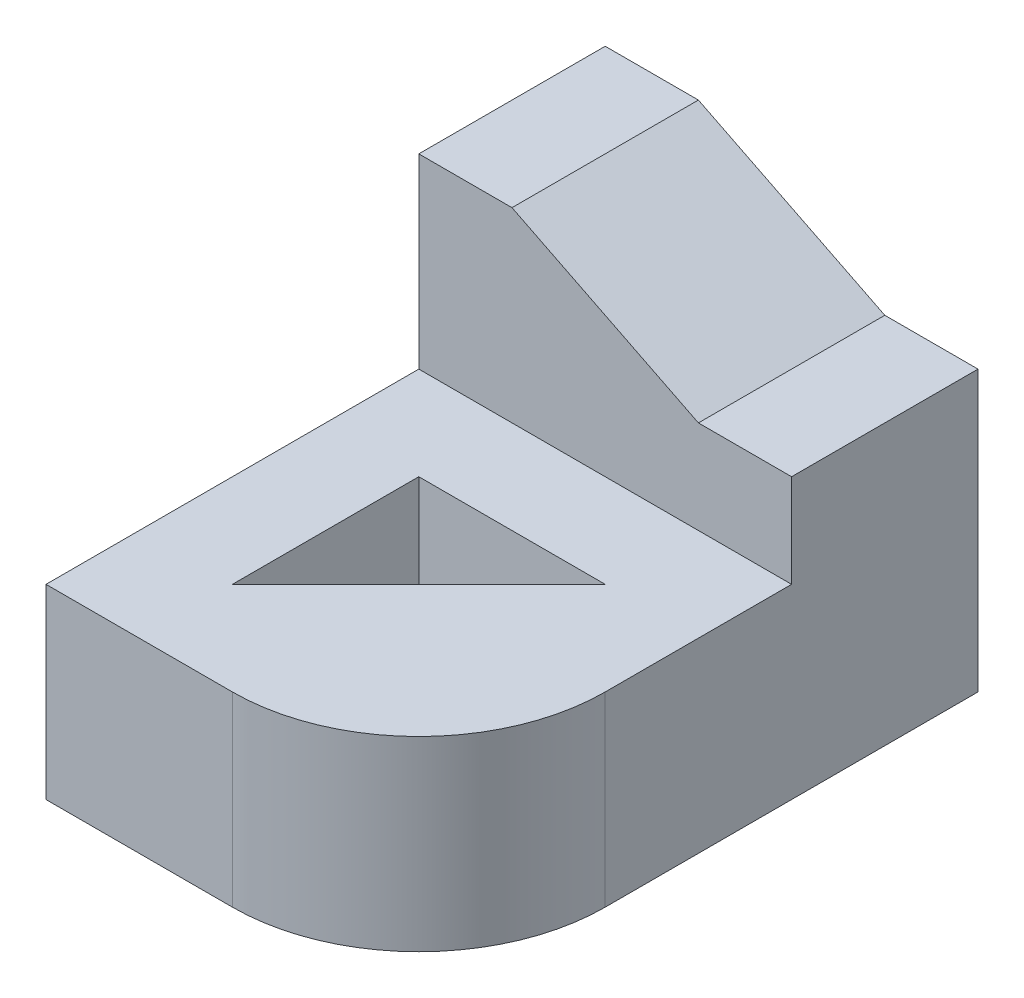
ISO-10303-21;
HEADER;
FILE_DESCRIPTION(('STEP AP214'),'2;1');
FILE_NAME('part.step','',(''),(''),'','','');
FILE_SCHEMA(('AUTOMOTIVE_DESIGN { 1 0 10303 214 1 1 1 1 }'));
ENDSEC;
DATA;
#1=APPLICATION_CONTEXT('core data for automotive mechanical design processes');
#2=APPLICATION_PROTOCOL_DEFINITION('international standard','automotive_design',2000,#1);
#3=PRODUCT_CONTEXT('',#1,'mechanical');
#4=PRODUCT('Part','Part','',(#3));
#5=PRODUCT_RELATED_PRODUCT_CATEGORY('part','',(#4));
#6=PRODUCT_DEFINITION_FORMATION('','',#4);
#7=PRODUCT_DEFINITION_CONTEXT('part definition',#1,'design');
#8=PRODUCT_DEFINITION('design','',#6,#7);
#9=PRODUCT_DEFINITION_SHAPE('','',#8);
#10=(LENGTH_UNIT() NAMED_UNIT(*) SI_UNIT(.MILLI.,.METRE.));
#11=(NAMED_UNIT(*) PLANE_ANGLE_UNIT() SI_UNIT($,.RADIAN.));
#12=(NAMED_UNIT(*) SI_UNIT($,.STERADIAN.) SOLID_ANGLE_UNIT());
#13=UNCERTAINTY_MEASURE_WITH_UNIT(LENGTH_MEASURE(1.E-05),#10,'distance_accuracy_value','');
#14=(GEOMETRIC_REPRESENTATION_CONTEXT(3) GLOBAL_UNCERTAINTY_ASSIGNED_CONTEXT((#13)) GLOBAL_UNIT_ASSIGNED_CONTEXT((#10,
#11,#12)) REPRESENTATION_CONTEXT('',''));
#15=CARTESIAN_POINT('',(0.,0.,0.));
#16=DIRECTION('',(0.,0.,1.));
#17=DIRECTION('',(1.,0.,0.));
#18=AXIS2_PLACEMENT_3D('',#15,#16,#17);
#19=CARTESIAN_POINT('',(10.,10.,0.));
#20=DIRECTION('',(1.,0.,0.));
#21=DIRECTION('',(0.,0.,-1.));
#22=AXIS2_PLACEMENT_3D('',#19,#20,#21);
#23=PLANE('',#22);
#24=DIRECTION('',(0.,0.,1.));
#25=VECTOR('',#24,1.);
#26=CARTESIAN_POINT('',(10.,10.,0.));
#27=LINE('',#26,#25);
#28=CARTESIAN_POINT('',(9.99999999999999,10.,-10.));
#29=VERTEX_POINT('',#28);
#30=CARTESIAN_POINT('',(10.,10.,0.));
#31=VERTEX_POINT('',#30);
#32=EDGE_CURVE('E184',#29,#31,#27,.T.);
#33=ORIENTED_EDGE('',*,*,#32,.T.);
#34=DIRECTION('',(0.,-1.,0.));
#35=VECTOR('',#34,1.);
#36=CARTESIAN_POINT('',(10.,0.,0.));
#37=LINE('',#36,#35);
#38=CARTESIAN_POINT('',(10.,0.,0.));
#39=VERTEX_POINT('',#38);
#40=EDGE_CURVE('E219',#31,#39,#37,.T.);
#41=ORIENTED_EDGE('',*,*,#40,.T.);
#42=DIRECTION('',(0.,0.,1.));
#43=VECTOR('',#42,1.);
#44=CARTESIAN_POINT('',(10.,0.,0.));
#45=LINE('',#44,#43);
#46=CARTESIAN_POINT('',(10.,0.,-20.));
#47=VERTEX_POINT('',#46);
#48=EDGE_CURVE('E202',#47,#39,#45,.T.);
#49=ORIENTED_EDGE('',*,*,#48,.F.);
#50=DIRECTION('',(0.,-1.,0.));
#51=VECTOR('',#50,1.);
#52=CARTESIAN_POINT('',(10.,20.,-20.));
#53=LINE('',#52,#51);
#54=CARTESIAN_POINT('',(9.99999999999999,15.,-20.));
#55=VERTEX_POINT('',#54);
#56=EDGE_CURVE('E172',#55,#47,#53,.T.);
#57=ORIENTED_EDGE('',*,*,#56,.F.);
#58=DIRECTION('',(0.,0.,1.));
#59=VECTOR('',#58,1.);
#60=CARTESIAN_POINT('',(9.99999999999999,15.,-30.));
#61=LINE('',#60,#59);
#62=CARTESIAN_POINT('',(9.99999999999999,15.,-10.));
#63=VERTEX_POINT('',#62);
#64=EDGE_CURVE('E135',#55,#63,#61,.T.);
#65=ORIENTED_EDGE('',*,*,#64,.T.);
#66=DIRECTION('',(0.,-1.,0.));
#67=VECTOR('',#66,1.);
#68=CARTESIAN_POINT('',(9.99999999999999,20.,-10.));
#69=LINE('',#68,#67);
#70=EDGE_CURVE('E149',#63,#29,#69,.T.);
#71=ORIENTED_EDGE('',*,*,#70,.T.);
#72=EDGE_LOOP('',(#33,#41,#49,#57,#65,#71));
#73=FACE_BOUND('',#72,.T.);
#74=ADVANCED_FACE('F39',(#73),#23,.T.);
#75=CARTESIAN_POINT('',(-10.,10.,0.));
#76=DIRECTION('',(1.,0.,0.));
#77=DIRECTION('',(0.,0.,-1.));
#78=AXIS2_PLACEMENT_3D('',#75,#76,#77);
#79=PLANE('',#78);
#80=DIRECTION('',(0.,0.,1.));
#81=VECTOR('',#80,1.);
#82=CARTESIAN_POINT('',(-10.,0.,0.));
#83=LINE('',#82,#81);
#84=CARTESIAN_POINT('',(-10.,0.,-20.));
#85=VERTEX_POINT('',#84);
#86=CARTESIAN_POINT('',(-10.,0.,10.));
#87=VERTEX_POINT('',#86);
#88=EDGE_CURVE('E204',#85,#87,#83,.T.);
#89=ORIENTED_EDGE('',*,*,#88,.T.);
#90=DIRECTION('',(0.,-1.,0.));
#91=VECTOR('',#90,1.);
#92=CARTESIAN_POINT('',(-10.,10.,10.));
#93=LINE('',#92,#91);
#94=CARTESIAN_POINT('',(-10.,10.,10.));
#95=VERTEX_POINT('',#94);
#96=EDGE_CURVE('E208',#95,#87,#93,.T.);
#97=ORIENTED_EDGE('',*,*,#96,.F.);
#98=DIRECTION('',(0.,0.,1.));
#99=VECTOR('',#98,1.);
#100=CARTESIAN_POINT('',(-10.,10.,0.));
#101=LINE('',#100,#99);
#102=CARTESIAN_POINT('',(-10.,10.,-9.99999999999999));
#103=VERTEX_POINT('',#102);
#104=EDGE_CURVE('E189',#103,#95,#101,.T.);
#105=ORIENTED_EDGE('',*,*,#104,.F.);
#106=DIRECTION('',(0.,-1.,0.));
#107=VECTOR('',#106,1.);
#108=CARTESIAN_POINT('',(-10.,20.,-9.99999999999999));
#109=LINE('',#108,#107);
#110=CARTESIAN_POINT('',(-10.,20.,-9.99999999999999));
#111=VERTEX_POINT('',#110);
#112=EDGE_CURVE('E164',#111,#103,#109,.T.);
#113=ORIENTED_EDGE('',*,*,#112,.F.);
#114=DIRECTION('',(0.,0.,-1.));
#115=VECTOR('',#114,1.);
#116=CARTESIAN_POINT('',(-10.,20.,0.));
#117=LINE('',#116,#115);
#118=CARTESIAN_POINT('',(-10.,20.,-20.));
#119=VERTEX_POINT('',#118);
#120=EDGE_CURVE('E161',#111,#119,#117,.T.);
#121=ORIENTED_EDGE('',*,*,#120,.T.);
#122=DIRECTION('',(0.,-1.,0.));
#123=VECTOR('',#122,1.);
#124=CARTESIAN_POINT('',(-10.,20.,-20.));
#125=LINE('',#124,#123);
#126=EDGE_CURVE('E169',#119,#85,#125,.T.);
#127=ORIENTED_EDGE('',*,*,#126,.T.);
#128=EDGE_LOOP('',(#89,#97,#105,#113,#121,#127));
#129=FACE_BOUND('',#128,.T.);
#130=ADVANCED_FACE('F239',(#129),#79,.F.);
#131=CARTESIAN_POINT('',(-5.,10.,0.));
#132=DIRECTION('',(1.,0.,0.));
#133=DIRECTION('',(0.,0.,-1.));
#134=AXIS2_PLACEMENT_3D('',#131,#132,#133);
#135=PLANE('',#134);
#136=DIRECTION('',(0.,0.,1.));
#137=VECTOR('',#136,1.);
#138=CARTESIAN_POINT('',(-5.,0.,0.));
#139=LINE('',#138,#137);
#140=CARTESIAN_POINT('',(-5.,0.,-5.));
#141=VERTEX_POINT('',#140);
#142=CARTESIAN_POINT('',(-5.,0.,5.));
#143=VERTEX_POINT('',#142);
#144=EDGE_CURVE('E175',#141,#143,#139,.T.);
#145=ORIENTED_EDGE('',*,*,#144,.F.);
#146=DIRECTION('',(0.,-1.,0.));
#147=VECTOR('',#146,1.);
#148=CARTESIAN_POINT('',(-5.,10.,-5.));
#149=LINE('',#148,#147);
#150=CARTESIAN_POINT('',(-5.,10.,-5.));
#151=VERTEX_POINT('',#150);
#152=EDGE_CURVE('E211',#151,#141,#149,.T.);
#153=ORIENTED_EDGE('',*,*,#152,.F.);
#154=DIRECTION('',(0.,0.,1.));
#155=VECTOR('',#154,1.);
#156=CARTESIAN_POINT('',(-5.,10.,0.));
#157=LINE('',#156,#155);
#158=CARTESIAN_POINT('',(-5.,10.,5.));
#159=VERTEX_POINT('',#158);
#160=EDGE_CURVE('E176',#151,#159,#157,.T.);
#161=ORIENTED_EDGE('',*,*,#160,.T.);
#162=DIRECTION('',(0.,-1.,0.));
#163=VECTOR('',#162,1.);
#164=CARTESIAN_POINT('',(-5.,10.,5.));
#165=LINE('',#164,#163);
#166=EDGE_CURVE('E194',#159,#143,#165,.T.);
#167=ORIENTED_EDGE('',*,*,#166,.T.);
#168=EDGE_LOOP('',(#145,#153,#161,#167));
#169=FACE_BOUND('',#168,.T.);
#170=ADVANCED_FACE('F251',(#169),#135,.T.);
#171=CARTESIAN_POINT('',(0.,10.,-5.));
#172=DIRECTION('',(0.,0.,-1.));
#173=DIRECTION('',(-1.,0.,0.));
#174=AXIS2_PLACEMENT_3D('',#171,#172,#173);
#175=PLANE('',#174);
#176=DIRECTION('',(1.,0.,0.));
#177=VECTOR('',#176,1.);
#178=CARTESIAN_POINT('',(0.,0.,-5.));
#179=LINE('',#178,#177);
#180=CARTESIAN_POINT('',(5.,0.,-5.));
#181=VERTEX_POINT('',#180);
#182=EDGE_CURVE('E197',#141,#181,#179,.T.);
#183=ORIENTED_EDGE('',*,*,#182,.T.);
#184=DIRECTION('',(0.,-1.,0.));
#185=VECTOR('',#184,1.);
#186=CARTESIAN_POINT('',(5.,10.,-5.));
#187=LINE('',#186,#185);
#188=CARTESIAN_POINT('',(5.,10.,-5.));
#189=VERTEX_POINT('',#188);
#190=EDGE_CURVE('E213',#189,#181,#187,.T.);
#191=ORIENTED_EDGE('',*,*,#190,.F.);
#192=DIRECTION('',(1.,0.,0.));
#193=VECTOR('',#192,1.);
#194=CARTESIAN_POINT('',(0.,10.,-5.));
#195=LINE('',#194,#193);
#196=EDGE_CURVE('E179',#151,#189,#195,.T.);
#197=ORIENTED_EDGE('',*,*,#196,.F.);
#198=ORIENTED_EDGE('',*,*,#152,.T.);
#199=EDGE_LOOP('',(#183,#191,#197,#198));
#200=FACE_BOUND('',#199,.T.);
#201=ADVANCED_FACE('F259',(#200),#175,.F.);
#202=CARTESIAN_POINT('',(0.,10.,0.));
#203=DIRECTION('',(0.707106781186548,0.,0.707106781186548));
#204=DIRECTION('',(0.707106781186548,0.,-0.707106781186548));
#205=AXIS2_PLACEMENT_3D('',#202,#203,#204);
#206=PLANE('',#205);
#207=DIRECTION('',(-0.707106781186548,0.,0.707106781186548));
#208=VECTOR('',#207,1.);
#209=CARTESIAN_POINT('',(0.,0.,0.));
#210=LINE('',#209,#208);
#211=EDGE_CURVE('E199',#181,#143,#210,.T.);
#212=ORIENTED_EDGE('',*,*,#211,.T.);
#213=ORIENTED_EDGE('',*,*,#166,.F.);
#214=DIRECTION('',(-0.707106781186548,0.,0.707106781186548));
#215=VECTOR('',#214,1.);
#216=CARTESIAN_POINT('',(0.,10.,0.));
#217=LINE('',#216,#215);
#218=EDGE_CURVE('E182',#189,#159,#217,.T.);
#219=ORIENTED_EDGE('',*,*,#218,.F.);
#220=ORIENTED_EDGE('',*,*,#190,.T.);
#221=EDGE_LOOP('',(#212,#213,#219,#220));
#222=FACE_BOUND('',#221,.T.);
#223=ADVANCED_FACE('F255',(#222),#206,.F.);
#224=CARTESIAN_POINT('',(0.,10.,10.));
#225=DIRECTION('',(0.,0.,-1.));
#226=DIRECTION('',(-1.,0.,0.));
#227=AXIS2_PLACEMENT_3D('',#224,#225,#226);
#228=PLANE('',#227);
#229=DIRECTION('',(1.,0.,0.));
#230=VECTOR('',#229,1.);
#231=CARTESIAN_POINT('',(0.,0.,10.));
#232=LINE('',#231,#230);
#233=CARTESIAN_POINT('',(0.,0.,10.));
#234=VERTEX_POINT('',#233);
#235=EDGE_CURVE('E180',#87,#234,#232,.T.);
#236=ORIENTED_EDGE('',*,*,#235,.T.);
#237=DIRECTION('',(0.,-1.,0.));
#238=VECTOR('',#237,1.);
#239=CARTESIAN_POINT('',(0.,10.,10.));
#240=LINE('',#239,#238);
#241=CARTESIAN_POINT('',(0.,10.,10.));
#242=VERTEX_POINT('',#241);
#243=EDGE_CURVE('E47',#234,#242,#240,.F.);
#244=ORIENTED_EDGE('',*,*,#243,.T.);
#245=DIRECTION('',(1.,0.,0.));
#246=VECTOR('',#245,1.);
#247=CARTESIAN_POINT('',(0.,10.,10.));
#248=LINE('',#247,#246);
#249=EDGE_CURVE('E192',#95,#242,#248,.T.);
#250=ORIENTED_EDGE('',*,*,#249,.F.);
#251=ORIENTED_EDGE('',*,*,#96,.T.);
#252=EDGE_LOOP('',(#236,#244,#250,#251));
#253=FACE_BOUND('',#252,.T.);
#254=ADVANCED_FACE('F258',(#253),#228,.F.);
#255=CARTESIAN_POINT('',(0.,10.,0.));
#256=DIRECTION('',(0.,1.,0.));
#257=DIRECTION('',(0.,0.,1.));
#258=AXIS2_PLACEMENT_3D('',#255,#256,#257);
#259=PLANE('',#258);
#260=ORIENTED_EDGE('',*,*,#160,.F.);
#261=ORIENTED_EDGE('',*,*,#196,.T.);
#262=ORIENTED_EDGE('',*,*,#218,.T.);
#263=EDGE_LOOP('',(#260,#261,#262));
#264=FACE_BOUND('',#263,.T.);
#265=ORIENTED_EDGE('',*,*,#249,.T.);
#266=CARTESIAN_POINT('',(0.,10.,0.));
#267=DIRECTION('',(0.,1.,0.));
#268=DIRECTION('',(0.,0.,1.));
#269=AXIS2_PLACEMENT_3D('',#266,#267,#268);
#270=CIRCLE('',#269,10.);
#271=EDGE_CURVE('E11',#242,#31,#270,.T.);
#272=ORIENTED_EDGE('',*,*,#271,.T.);
#273=ORIENTED_EDGE('',*,*,#32,.F.);
#274=DIRECTION('',(1.,0.,0.));
#275=VECTOR('',#274,1.);
#276=CARTESIAN_POINT('',(0.,10.,-10.));
#277=LINE('',#276,#275);
#278=EDGE_CURVE('E187',#103,#29,#277,.T.);
#279=ORIENTED_EDGE('',*,*,#278,.F.);
#280=ORIENTED_EDGE('',*,*,#104,.T.);
#281=EDGE_LOOP('',(#265,#272,#273,#279,#280));
#282=FACE_BOUND('',#281,.T.);
#283=ADVANCED_FACE('F236',(#264,#282),#259,.T.);
#284=CARTESIAN_POINT('',(0.,0.,0.));
#285=DIRECTION('',(0.,1.,0.));
#286=DIRECTION('',(0.,0.,1.));
#287=AXIS2_PLACEMENT_3D('',#284,#285,#286);
#288=PLANE('',#287);
#289=ORIENTED_EDGE('',*,*,#144,.T.);
#290=ORIENTED_EDGE('',*,*,#211,.F.);
#291=ORIENTED_EDGE('',*,*,#182,.F.);
#292=EDGE_LOOP('',(#289,#290,#291));
#293=FACE_BOUND('',#292,.T.);
#294=ORIENTED_EDGE('',*,*,#48,.T.);
#295=CARTESIAN_POINT('',(0.,0.,0.));
#296=DIRECTION('',(0.,1.,0.));
#297=DIRECTION('',(0.,0.,1.));
#298=AXIS2_PLACEMENT_3D('',#295,#296,#297);
#299=CIRCLE('',#298,10.);
#300=EDGE_CURVE('E61',#39,#234,#299,.F.);
#301=ORIENTED_EDGE('',*,*,#300,.T.);
#302=ORIENTED_EDGE('',*,*,#235,.F.);
#303=ORIENTED_EDGE('',*,*,#88,.F.);
#304=DIRECTION('',(1.,0.,0.));
#305=VECTOR('',#304,1.);
#306=CARTESIAN_POINT('',(0.,0.,-20.));
#307=LINE('',#306,#305);
#308=EDGE_CURVE('E155',#85,#47,#307,.T.);
#309=ORIENTED_EDGE('',*,*,#308,.T.);
#310=EDGE_LOOP('',(#294,#301,#302,#303,#309));
#311=FACE_BOUND('',#310,.T.);
#312=ADVANCED_FACE('F229',(#293,#311),#288,.F.);
#313=CARTESIAN_POINT('',(0.,20.,-10.));
#314=DIRECTION('',(0.,0.,-1.));
#315=DIRECTION('',(-1.,0.,0.));
#316=AXIS2_PLACEMENT_3D('',#313,#314,#315);
#317=PLANE('',#316);
#318=DIRECTION('',(1.,0.,0.));
#319=VECTOR('',#318,1.);
#320=CARTESIAN_POINT('',(0.,15.,-10.));
#321=LINE('',#320,#319);
#322=CARTESIAN_POINT('',(4.99999999999999,15.,-10.));
#323=VERTEX_POINT('',#322);
#324=EDGE_CURVE('E129',#323,#63,#321,.T.);
#325=ORIENTED_EDGE('',*,*,#324,.F.);
#326=DIRECTION('',(0.894427190999916,-0.447213595499958,0.));
#327=VECTOR('',#326,1.);
#328=CARTESIAN_POINT('',(7.,14.,-10.));
#329=LINE('',#328,#327);
#330=CARTESIAN_POINT('',(-5.,20.,-10.));
#331=VERTEX_POINT('',#330);
#332=EDGE_CURVE('E138',#331,#323,#329,.T.);
#333=ORIENTED_EDGE('',*,*,#332,.F.);
#334=DIRECTION('',(1.,0.,0.));
#335=VECTOR('',#334,1.);
#336=CARTESIAN_POINT('',(0.,20.,-10.));
#337=LINE('',#336,#335);
#338=EDGE_CURVE('E156',#111,#331,#337,.T.);
#339=ORIENTED_EDGE('',*,*,#338,.F.);
#340=ORIENTED_EDGE('',*,*,#112,.T.);
#341=ORIENTED_EDGE('',*,*,#278,.T.);
#342=ORIENTED_EDGE('',*,*,#70,.F.);
#343=EDGE_LOOP('',(#325,#333,#339,#340,#341,#342));
#344=FACE_BOUND('',#343,.T.);
#345=ADVANCED_FACE('F147',(#344),#317,.F.);
#346=CARTESIAN_POINT('',(0.,20.,-20.));
#347=DIRECTION('',(0.,0.,-1.));
#348=DIRECTION('',(-1.,0.,0.));
#349=AXIS2_PLACEMENT_3D('',#346,#347,#348);
#350=PLANE('',#349);
#351=DIRECTION('',(-0.894427190999916,0.447213595499958,0.));
#352=VECTOR('',#351,1.);
#353=CARTESIAN_POINT('',(-0.999999999999999,18.,-20.));
#354=LINE('',#353,#352);
#355=CARTESIAN_POINT('',(4.99999999999999,15.,-20.));
#356=VERTEX_POINT('',#355);
#357=CARTESIAN_POINT('',(-4.99999999999999,20.,-20.));
#358=VERTEX_POINT('',#357);
#359=EDGE_CURVE('E152',#356,#358,#354,.T.);
#360=ORIENTED_EDGE('',*,*,#359,.F.);
#361=DIRECTION('',(-1.,0.,0.));
#362=VECTOR('',#361,1.);
#363=CARTESIAN_POINT('',(0.,15.,-20.));
#364=LINE('',#363,#362);
#365=EDGE_CURVE('E132',#55,#356,#364,.T.);
#366=ORIENTED_EDGE('',*,*,#365,.F.);
#367=ORIENTED_EDGE('',*,*,#56,.T.);
#368=ORIENTED_EDGE('',*,*,#308,.F.);
#369=ORIENTED_EDGE('',*,*,#126,.F.);
#370=DIRECTION('',(1.,0.,0.));
#371=VECTOR('',#370,1.);
#372=CARTESIAN_POINT('',(0.,20.,-20.));
#373=LINE('',#372,#371);
#374=EDGE_CURVE('E158',#119,#358,#373,.T.);
#375=ORIENTED_EDGE('',*,*,#374,.T.);
#376=EDGE_LOOP('',(#360,#366,#367,#368,#369,#375));
#377=FACE_BOUND('',#376,.T.);
#378=ADVANCED_FACE('F232',(#377),#350,.T.);
#379=CARTESIAN_POINT('',(0.,20.,0.));
#380=DIRECTION('',(0.,1.,0.));
#381=DIRECTION('',(0.,0.,1.));
#382=AXIS2_PLACEMENT_3D('',#379,#380,#381);
#383=PLANE('',#382);
#384=DIRECTION('',(0.,0.,1.));
#385=VECTOR('',#384,1.);
#386=CARTESIAN_POINT('',(-4.99999999999999,20.,0.));
#387=LINE('',#386,#385);
#388=EDGE_CURVE('E141',#358,#331,#387,.T.);
#389=ORIENTED_EDGE('',*,*,#388,.F.);
#390=ORIENTED_EDGE('',*,*,#374,.F.);
#391=ORIENTED_EDGE('',*,*,#120,.F.);
#392=ORIENTED_EDGE('',*,*,#338,.T.);
#393=EDGE_LOOP('',(#389,#390,#391,#392));
#394=FACE_BOUND('',#393,.T.);
#395=ADVANCED_FACE('F289',(#394),#383,.T.);
#396=CARTESIAN_POINT('',(7.,14.,-30.));
#397=DIRECTION('',(-0.447213595499958,-0.894427190999916,0.));
#398=DIRECTION('',(0.894427190999916,-0.447213595499958,0.));
#399=AXIS2_PLACEMENT_3D('',#396,#397,#398);
#400=PLANE('',#399);
#401=ORIENTED_EDGE('',*,*,#359,.T.);
#402=ORIENTED_EDGE('',*,*,#388,.T.);
#403=ORIENTED_EDGE('',*,*,#332,.T.);
#404=DIRECTION('',(0.,0.,1.));
#405=VECTOR('',#404,1.);
#406=CARTESIAN_POINT('',(4.99999999999999,15.,-30.));
#407=LINE('',#406,#405);
#408=EDGE_CURVE('E125',#356,#323,#407,.T.);
#409=ORIENTED_EDGE('',*,*,#408,.F.);
#410=EDGE_LOOP('',(#401,#402,#403,#409));
#411=FACE_BOUND('',#410,.T.);
#412=ADVANCED_FACE('F139',(#411),#400,.F.);
#413=CARTESIAN_POINT('',(0.,15.,-30.));
#414=DIRECTION('',(0.,-1.,0.));
#415=DIRECTION('',(0.,0.,-1.));
#416=AXIS2_PLACEMENT_3D('',#413,#414,#415);
#417=PLANE('',#416);
#418=ORIENTED_EDGE('',*,*,#365,.T.);
#419=ORIENTED_EDGE('',*,*,#408,.T.);
#420=ORIENTED_EDGE('',*,*,#324,.T.);
#421=ORIENTED_EDGE('',*,*,#64,.F.);
#422=EDGE_LOOP('',(#418,#419,#420,#421));
#423=FACE_BOUND('',#422,.T.);
#424=ADVANCED_FACE('F127',(#423),#417,.F.);
#425=CARTESIAN_POINT('',(0.,10.,0.));
#426=DIRECTION('',(0.,1.,0.));
#427=DIRECTION('',(0.,0.,1.));
#428=AXIS2_PLACEMENT_3D('',#425,#426,#427);
#429=CYLINDRICAL_SURFACE('',#428,10.);
#430=ORIENTED_EDGE('',*,*,#271,.F.);
#431=ORIENTED_EDGE('',*,*,#243,.F.);
#432=ORIENTED_EDGE('',*,*,#300,.F.);
#433=ORIENTED_EDGE('',*,*,#40,.F.);
#434=EDGE_LOOP('',(#430,#431,#432,#433));
#435=FACE_BOUND('',#434,.T.);
#436=ADVANCED_FACE('F41',(#435),#429,.T.);
#437=CLOSED_SHELL('',(#74,#130,#170,#201,#223,#254,#283,#312,#345,#378,#395,#412,#424,#436));
#438=MANIFOLD_SOLID_BREP('B2',#437);
#439=ADVANCED_BREP_SHAPE_REPRESENTATION('',(#18,#438),#14);
#440=SHAPE_DEFINITION_REPRESENTATION(#9,#439);
ENDSEC;
END-ISO-10303-21;
